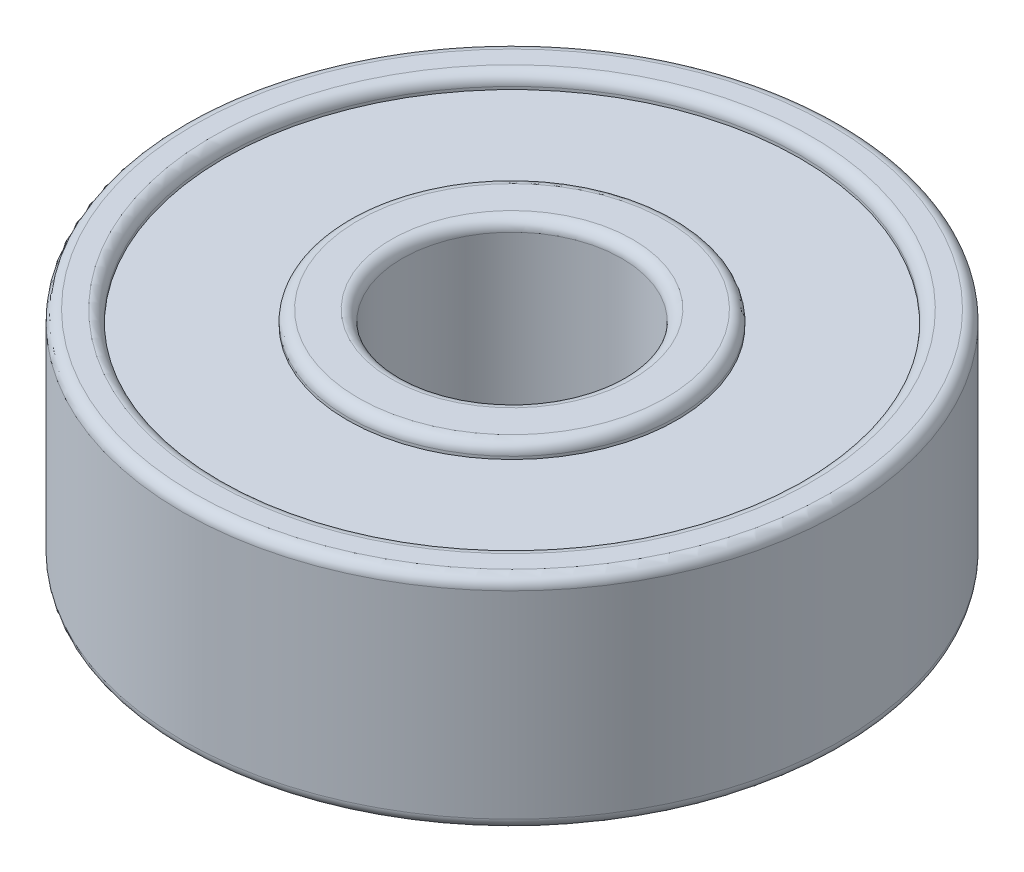
ISO-10303-21;
HEADER;
FILE_DESCRIPTION(('STEP AP214'),'2;1');
FILE_NAME('part.step','',(''),(''),'','','');
FILE_SCHEMA(('AUTOMOTIVE_DESIGN { 1 0 10303 214 1 1 1 1 }'));
ENDSEC;
DATA;
#1=APPLICATION_CONTEXT('core data for automotive mechanical design processes');
#2=APPLICATION_PROTOCOL_DEFINITION('international standard','automotive_design',2000,#1);
#3=PRODUCT_CONTEXT('',#1,'mechanical');
#4=PRODUCT('Part','Part','',(#3));
#5=PRODUCT_RELATED_PRODUCT_CATEGORY('part','',(#4));
#6=PRODUCT_DEFINITION_FORMATION('','',#4);
#7=PRODUCT_DEFINITION_CONTEXT('part definition',#1,'design');
#8=PRODUCT_DEFINITION('design','',#6,#7);
#9=PRODUCT_DEFINITION_SHAPE('','',#8);
#10=(LENGTH_UNIT() NAMED_UNIT(*) SI_UNIT(.MILLI.,.METRE.));
#11=(NAMED_UNIT(*) PLANE_ANGLE_UNIT() SI_UNIT($,.RADIAN.));
#12=(NAMED_UNIT(*) SI_UNIT($,.STERADIAN.) SOLID_ANGLE_UNIT());
#13=UNCERTAINTY_MEASURE_WITH_UNIT(LENGTH_MEASURE(1.E-05),#10,'distance_accuracy_value','');
#14=(GEOMETRIC_REPRESENTATION_CONTEXT(3) GLOBAL_UNCERTAINTY_ASSIGNED_CONTEXT((#13)) GLOBAL_UNIT_ASSIGNED_CONTEXT((#10,
#11,#12)) REPRESENTATION_CONTEXT('',''));
#15=CARTESIAN_POINT('',(0.,0.,0.));
#16=DIRECTION('',(0.,0.,1.));
#17=DIRECTION('',(1.,0.,0.));
#18=AXIS2_PLACEMENT_3D('',#15,#16,#17);
#19=CARTESIAN_POINT('',(0.,0.,0.));
#20=DIRECTION('',(0.,1.,0.));
#21=DIRECTION('',(0.,0.,1.));
#22=AXIS2_PLACEMENT_3D('',#19,#20,#21);
#23=PLANE('',#22);
#24=CARTESIAN_POINT('',(0.,0.,0.));
#25=DIRECTION('',(0.,1.,0.));
#26=DIRECTION('',(0.,0.,1.));
#27=AXIS2_PLACEMENT_3D('',#24,#25,#26);
#28=CIRCLE('',#27,2.2);
#29=CARTESIAN_POINT('',(0.,0.,2.2));
#30=VERTEX_POINT('',#29);
#31=EDGE_CURVE('E42',#30,#30,#28,.T.);
#32=ORIENTED_EDGE('',*,*,#31,.T.);
#33=EDGE_LOOP('',(#32));
#34=FACE_BOUND('',#33,.T.);
#35=CARTESIAN_POINT('',(0.,0.,0.));
#36=DIRECTION('',(0.,1.,0.));
#37=DIRECTION('',(0.,0.,1.));
#38=AXIS2_PLACEMENT_3D('',#35,#36,#37);
#39=CIRCLE('',#38,2.8);
#40=CARTESIAN_POINT('',(0.,0.,2.8));
#41=VERTEX_POINT('',#40);
#42=EDGE_CURVE('E46',#41,#41,#39,.F.);
#43=ORIENTED_EDGE('',*,*,#42,.T.);
#44=EDGE_LOOP('',(#43));
#45=FACE_BOUND('',#44,.T.);
#46=ADVANCED_FACE('F31',(#34,#45),#23,.F.);
#47=CARTESIAN_POINT('',(0.,4.,0.));
#48=DIRECTION('',(0.,1.,0.));
#49=DIRECTION('',(0.,0.,1.));
#50=AXIS2_PLACEMENT_3D('',#47,#48,#49);
#51=PLANE('',#50);
#52=CARTESIAN_POINT('',(0.,4.,0.));
#53=DIRECTION('',(0.,1.,0.));
#54=DIRECTION('',(0.,0.,1.));
#55=AXIS2_PLACEMENT_3D('',#52,#53,#54);
#56=CIRCLE('',#55,2.2);
#57=CARTESIAN_POINT('',(0.,4.,2.2));
#58=VERTEX_POINT('',#57);
#59=EDGE_CURVE('E75',#58,#58,#56,.F.);
#60=ORIENTED_EDGE('',*,*,#59,.T.);
#61=EDGE_LOOP('',(#60));
#62=FACE_BOUND('',#61,.T.);
#63=CARTESIAN_POINT('',(0.,4.,0.));
#64=DIRECTION('',(0.,1.,0.));
#65=DIRECTION('',(0.,0.,1.));
#66=AXIS2_PLACEMENT_3D('',#63,#64,#65);
#67=CIRCLE('',#66,2.8);
#68=CARTESIAN_POINT('',(0.,4.,2.8));
#69=VERTEX_POINT('',#68);
#70=EDGE_CURVE('E78',#69,#69,#67,.T.);
#71=ORIENTED_EDGE('',*,*,#70,.T.);
#72=EDGE_LOOP('',(#71));
#73=FACE_BOUND('',#72,.T.);
#74=ADVANCED_FACE('F119',(#62,#73),#51,.T.);
#75=CARTESIAN_POINT('',(0.,4.,0.));
#76=DIRECTION('',(0.,1.,0.));
#77=DIRECTION('',(0.,0.,1.));
#78=AXIS2_PLACEMENT_3D('',#75,#76,#77);
#79=CIRCLE('',#78,5.45);
#80=CARTESIAN_POINT('',(0.,4.,5.45));
#81=VERTEX_POINT('',#80);
#82=EDGE_CURVE('E63',#81,#81,#79,.F.);
#83=ORIENTED_EDGE('',*,*,#82,.T.);
#84=EDGE_LOOP('',(#83));
#85=FACE_BOUND('',#84,.T.);
#86=CARTESIAN_POINT('',(0.,4.,0.));
#87=DIRECTION('',(0.,1.,0.));
#88=DIRECTION('',(0.,0.,1.));
#89=AXIS2_PLACEMENT_3D('',#86,#87,#88);
#90=CIRCLE('',#89,5.8);
#91=CARTESIAN_POINT('',(0.,4.,5.8));
#92=VERTEX_POINT('',#91);
#93=EDGE_CURVE('E66',#92,#92,#90,.T.);
#94=ORIENTED_EDGE('',*,*,#93,.T.);
#95=EDGE_LOOP('',(#94));
#96=FACE_BOUND('',#95,.T.);
#97=ADVANCED_FACE('F127',(#85,#96),#51,.T.);
#98=CARTESIAN_POINT('',(0.,0.,0.));
#99=DIRECTION('',(0.,1.,0.));
#100=DIRECTION('',(0.,0.,1.));
#101=AXIS2_PLACEMENT_3D('',#98,#99,#100);
#102=CIRCLE('',#101,5.8);
#103=CARTESIAN_POINT('',(0.,0.,5.8));
#104=VERTEX_POINT('',#103);
#105=EDGE_CURVE('E51',#104,#104,#102,.F.);
#106=ORIENTED_EDGE('',*,*,#105,.T.);
#107=EDGE_LOOP('',(#106));
#108=FACE_BOUND('',#107,.T.);
#109=CARTESIAN_POINT('',(0.,0.,0.));
#110=DIRECTION('',(0.,1.,0.));
#111=DIRECTION('',(0.,0.,1.));
#112=AXIS2_PLACEMENT_3D('',#109,#110,#111);
#113=CIRCLE('',#112,5.45);
#114=CARTESIAN_POINT('',(0.,0.,5.45));
#115=VERTEX_POINT('',#114);
#116=EDGE_CURVE('E54',#115,#115,#113,.T.);
#117=ORIENTED_EDGE('',*,*,#116,.T.);
#118=EDGE_LOOP('',(#117));
#119=FACE_BOUND('',#118,.T.);
#120=ADVANCED_FACE('F122',(#108,#119),#23,.F.);
#121=CARTESIAN_POINT('',(0.,4.,0.));
#122=DIRECTION('',(0.,-1.,0.));
#123=DIRECTION('',(0.,0.,-1.));
#124=AXIS2_PLACEMENT_3D('',#121,#122,#123);
#125=CYLINDRICAL_SURFACE('',#124,6.);
#126=CARTESIAN_POINT('',(0.,3.8,0.));
#127=DIRECTION('',(0.,1.,0.));
#128=DIRECTION('',(0.,0.,1.));
#129=AXIS2_PLACEMENT_3D('',#126,#127,#128);
#130=CIRCLE('',#129,6.);
#131=CARTESIAN_POINT('',(0.,3.8,6.));
#132=VERTEX_POINT('',#131);
#133=EDGE_CURVE('E57',#132,#132,#130,.F.);
#134=ORIENTED_EDGE('',*,*,#133,.T.);
#135=EDGE_LOOP('',(#134));
#136=FACE_BOUND('',#135,.T.);
#137=CARTESIAN_POINT('',(0.,0.2,0.));
#138=DIRECTION('',(0.,1.,0.));
#139=DIRECTION('',(0.,0.,1.));
#140=AXIS2_PLACEMENT_3D('',#137,#138,#139);
#141=CIRCLE('',#140,6.);
#142=CARTESIAN_POINT('',(0.,0.2,6.));
#143=VERTEX_POINT('',#142);
#144=EDGE_CURVE('E60',#143,#143,#141,.T.);
#145=ORIENTED_EDGE('',*,*,#144,.T.);
#146=EDGE_LOOP('',(#145));
#147=FACE_BOUND('',#146,.T.);
#148=ADVANCED_FACE('F133',(#136,#147),#125,.T.);
#149=CARTESIAN_POINT('',(0.,4.,0.));
#150=DIRECTION('',(0.,-1.,0.));
#151=DIRECTION('',(0.,0.,-1.));
#152=AXIS2_PLACEMENT_3D('',#149,#150,#151);
#153=CYLINDRICAL_SURFACE('',#152,2.);
#154=CARTESIAN_POINT('',(0.,3.8,0.));
#155=DIRECTION('',(0.,1.,0.));
#156=DIRECTION('',(0.,0.,1.));
#157=AXIS2_PLACEMENT_3D('',#154,#155,#156);
#158=CIRCLE('',#157,2.);
#159=CARTESIAN_POINT('',(0.,3.8,2.));
#160=VERTEX_POINT('',#159);
#161=EDGE_CURVE('E81',#160,#160,#158,.T.);
#162=ORIENTED_EDGE('',*,*,#161,.T.);
#163=EDGE_LOOP('',(#162));
#164=FACE_BOUND('',#163,.T.);
#165=CARTESIAN_POINT('',(0.,0.2,0.));
#166=DIRECTION('',(0.,1.,0.));
#167=DIRECTION('',(0.,0.,1.));
#168=AXIS2_PLACEMENT_3D('',#165,#166,#167);
#169=CIRCLE('',#168,2.);
#170=CARTESIAN_POINT('',(0.,0.2,2.));
#171=VERTEX_POINT('',#170);
#172=EDGE_CURVE('E84',#171,#171,#169,.F.);
#173=ORIENTED_EDGE('',*,*,#172,.T.);
#174=EDGE_LOOP('',(#173));
#175=FACE_BOUND('',#174,.T.);
#176=ADVANCED_FACE('F139',(#164,#175),#153,.F.);
#177=CARTESIAN_POINT('',(0.,3.75,0.));
#178=DIRECTION('',(0.,1.,0.));
#179=DIRECTION('',(0.,0.,1.));
#180=AXIS2_PLACEMENT_3D('',#177,#178,#179);
#181=CYLINDRICAL_SURFACE('',#180,5.25);
#182=CARTESIAN_POINT('',(0.,3.8,0.));
#183=DIRECTION('',(0.,1.,0.));
#184=DIRECTION('',(0.,0.,1.));
#185=AXIS2_PLACEMENT_3D('',#182,#183,#184);
#186=CIRCLE('',#185,5.25);
#187=CARTESIAN_POINT('',(0.,3.8,5.25));
#188=VERTEX_POINT('',#187);
#189=EDGE_CURVE('E69',#188,#188,#186,.T.);
#190=ORIENTED_EDGE('',*,*,#189,.T.);
#191=EDGE_LOOP('',(#190));
#192=FACE_BOUND('',#191,.T.);
#193=CARTESIAN_POINT('',(0.,3.75,0.));
#194=DIRECTION('',(0.,1.,0.));
#195=DIRECTION('',(0.,0.,1.));
#196=AXIS2_PLACEMENT_3D('',#193,#194,#195);
#197=CIRCLE('',#196,5.25);
#198=CARTESIAN_POINT('',(0.,3.75,5.25));
#199=VERTEX_POINT('',#198);
#200=EDGE_CURVE('E87',#199,#199,#197,.T.);
#201=ORIENTED_EDGE('',*,*,#200,.F.);
#202=EDGE_LOOP('',(#201));
#203=FACE_BOUND('',#202,.T.);
#204=ADVANCED_FACE('F190',(#192,#203),#181,.F.);
#205=CARTESIAN_POINT('',(0.,3.75,0.));
#206=DIRECTION('',(0.,1.,0.));
#207=DIRECTION('',(0.,0.,1.));
#208=AXIS2_PLACEMENT_3D('',#205,#206,#207);
#209=PLANE('',#208);
#210=CARTESIAN_POINT('',(0.,3.75,0.));
#211=DIRECTION('',(0.,1.,0.));
#212=DIRECTION('',(0.,0.,1.));
#213=AXIS2_PLACEMENT_3D('',#210,#211,#212);
#214=CIRCLE('',#213,3.);
#215=CARTESIAN_POINT('',(0.,3.75,3.));
#216=VERTEX_POINT('',#215);
#217=EDGE_CURVE('E90',#216,#216,#214,.T.);
#218=ORIENTED_EDGE('',*,*,#217,.F.);
#219=EDGE_LOOP('',(#218));
#220=FACE_BOUND('',#219,.T.);
#221=ORIENTED_EDGE('',*,*,#200,.T.);
#222=EDGE_LOOP('',(#221));
#223=FACE_BOUND('',#222,.T.);
#224=ADVANCED_FACE('F115',(#220,#223),#209,.T.);
#225=CARTESIAN_POINT('',(0.,3.75,0.));
#226=DIRECTION('',(0.,1.,0.));
#227=DIRECTION('',(0.,0.,1.));
#228=AXIS2_PLACEMENT_3D('',#225,#226,#227);
#229=CYLINDRICAL_SURFACE('',#228,3.);
#230=CARTESIAN_POINT('',(0.,3.8,0.));
#231=DIRECTION('',(0.,1.,0.));
#232=DIRECTION('',(0.,0.,1.));
#233=AXIS2_PLACEMENT_3D('',#230,#231,#232);
#234=CIRCLE('',#233,3.);
#235=CARTESIAN_POINT('',(0.,3.8,3.));
#236=VERTEX_POINT('',#235);
#237=EDGE_CURVE('E72',#236,#236,#234,.F.);
#238=ORIENTED_EDGE('',*,*,#237,.T.);
#239=EDGE_LOOP('',(#238));
#240=FACE_BOUND('',#239,.T.);
#241=ORIENTED_EDGE('',*,*,#217,.T.);
#242=EDGE_LOOP('',(#241));
#243=FACE_BOUND('',#242,.T.);
#244=ADVANCED_FACE('F110',(#240,#243),#229,.T.);
#245=CARTESIAN_POINT('',(0.,0.25,0.));
#246=DIRECTION('',(0.,-1.,0.));
#247=DIRECTION('',(0.,0.,-1.));
#248=AXIS2_PLACEMENT_3D('',#245,#246,#247);
#249=CYLINDRICAL_SURFACE('',#248,5.25);
#250=CARTESIAN_POINT('',(0.,0.2,0.));
#251=DIRECTION('',(0.,1.,0.));
#252=DIRECTION('',(0.,0.,1.));
#253=AXIS2_PLACEMENT_3D('',#250,#251,#252);
#254=CIRCLE('',#253,5.25);
#255=CARTESIAN_POINT('',(0.,0.2,5.25));
#256=VERTEX_POINT('',#255);
#257=EDGE_CURVE('E10',#256,#256,#254,.F.);
#258=ORIENTED_EDGE('',*,*,#257,.T.);
#259=EDGE_LOOP('',(#258));
#260=FACE_BOUND('',#259,.T.);
#261=CARTESIAN_POINT('',(0.,0.25,0.));
#262=DIRECTION('',(0.,-1.,0.));
#263=DIRECTION('',(0.,0.,-1.));
#264=AXIS2_PLACEMENT_3D('',#261,#262,#263);
#265=CIRCLE('',#264,5.25);
#266=CARTESIAN_POINT('',(0.,0.25,-5.25));
#267=VERTEX_POINT('',#266);
#268=EDGE_CURVE('E93',#267,#267,#265,.T.);
#269=ORIENTED_EDGE('',*,*,#268,.F.);
#270=EDGE_LOOP('',(#269));
#271=FACE_BOUND('',#270,.T.);
#272=ADVANCED_FACE('F105',(#260,#271),#249,.F.);
#273=CARTESIAN_POINT('',(0.,0.25,0.));
#274=DIRECTION('',(0.,-1.,0.));
#275=DIRECTION('',(0.,0.,-1.));
#276=AXIS2_PLACEMENT_3D('',#273,#274,#275);
#277=PLANE('',#276);
#278=CARTESIAN_POINT('',(0.,0.25,0.));
#279=DIRECTION('',(0.,-1.,0.));
#280=DIRECTION('',(0.,0.,-1.));
#281=AXIS2_PLACEMENT_3D('',#278,#279,#280);
#282=CIRCLE('',#281,3.);
#283=CARTESIAN_POINT('',(0.,0.25,-3.));
#284=VERTEX_POINT('',#283);
#285=EDGE_CURVE('E96',#284,#284,#282,.T.);
#286=ORIENTED_EDGE('',*,*,#285,.F.);
#287=EDGE_LOOP('',(#286));
#288=FACE_BOUND('',#287,.T.);
#289=ORIENTED_EDGE('',*,*,#268,.T.);
#290=EDGE_LOOP('',(#289));
#291=FACE_BOUND('',#290,.T.);
#292=ADVANCED_FACE('F102',(#288,#291),#277,.T.);
#293=CARTESIAN_POINT('',(0.,0.25,0.));
#294=DIRECTION('',(0.,-1.,0.));
#295=DIRECTION('',(0.,0.,-1.));
#296=AXIS2_PLACEMENT_3D('',#293,#294,#295);
#297=CYLINDRICAL_SURFACE('',#296,3.);
#298=CARTESIAN_POINT('',(0.,0.2,0.));
#299=DIRECTION('',(0.,1.,0.));
#300=DIRECTION('',(0.,0.,1.));
#301=AXIS2_PLACEMENT_3D('',#298,#299,#300);
#302=CIRCLE('',#301,3.);
#303=CARTESIAN_POINT('',(0.,0.2,3.));
#304=VERTEX_POINT('',#303);
#305=EDGE_CURVE('E38',#304,#304,#302,.T.);
#306=ORIENTED_EDGE('',*,*,#305,.T.);
#307=EDGE_LOOP('',(#306));
#308=FACE_BOUND('',#307,.T.);
#309=ORIENTED_EDGE('',*,*,#285,.T.);
#310=EDGE_LOOP('',(#309));
#311=FACE_BOUND('',#310,.T.);
#312=ADVANCED_FACE('F100',(#308,#311),#297,.T.);
#313=CARTESIAN_POINT('',(0.,3.8,0.));
#314=DIRECTION('',(0.,1.,0.));
#315=DIRECTION('',(0.,0.,1.));
#316=AXIS2_PLACEMENT_3D('',#313,#314,#315);
#317=TOROIDAL_SURFACE('',#316,2.2,0.2);
#318=ORIENTED_EDGE('',*,*,#59,.F.);
#319=EDGE_LOOP('',(#318));
#320=FACE_BOUND('',#319,.T.);
#321=ORIENTED_EDGE('',*,*,#161,.F.);
#322=EDGE_LOOP('',(#321));
#323=FACE_BOUND('',#322,.T.);
#324=ADVANCED_FACE('F176',(#320,#323),#317,.T.);
#325=CARTESIAN_POINT('',(0.,3.8,0.));
#326=DIRECTION('',(0.,1.,0.));
#327=DIRECTION('',(0.,0.,1.));
#328=AXIS2_PLACEMENT_3D('',#325,#326,#327);
#329=TOROIDAL_SURFACE('',#328,2.8,0.2);
#330=ORIENTED_EDGE('',*,*,#237,.F.);
#331=EDGE_LOOP('',(#330));
#332=FACE_BOUND('',#331,.T.);
#333=ORIENTED_EDGE('',*,*,#70,.F.);
#334=EDGE_LOOP('',(#333));
#335=FACE_BOUND('',#334,.T.);
#336=ADVANCED_FACE('F172',(#332,#335),#329,.T.);
#337=CARTESIAN_POINT('',(0.,3.8,0.));
#338=DIRECTION('',(0.,1.,0.));
#339=DIRECTION('',(0.,0.,1.));
#340=AXIS2_PLACEMENT_3D('',#337,#338,#339);
#341=TOROIDAL_SURFACE('',#340,5.45,0.2);
#342=ORIENTED_EDGE('',*,*,#82,.F.);
#343=EDGE_LOOP('',(#342));
#344=FACE_BOUND('',#343,.T.);
#345=ORIENTED_EDGE('',*,*,#189,.F.);
#346=EDGE_LOOP('',(#345));
#347=FACE_BOUND('',#346,.T.);
#348=ADVANCED_FACE('F168',(#344,#347),#341,.T.);
#349=CARTESIAN_POINT('',(0.,3.8,0.));
#350=DIRECTION('',(0.,1.,0.));
#351=DIRECTION('',(0.,0.,1.));
#352=AXIS2_PLACEMENT_3D('',#349,#350,#351);
#353=TOROIDAL_SURFACE('',#352,5.8,0.2);
#354=ORIENTED_EDGE('',*,*,#133,.F.);
#355=EDGE_LOOP('',(#354));
#356=FACE_BOUND('',#355,.T.);
#357=ORIENTED_EDGE('',*,*,#93,.F.);
#358=EDGE_LOOP('',(#357));
#359=FACE_BOUND('',#358,.T.);
#360=ADVANCED_FACE('F164',(#356,#359),#353,.T.);
#361=CARTESIAN_POINT('',(0.,0.2,0.));
#362=DIRECTION('',(0.,1.,0.));
#363=DIRECTION('',(0.,0.,1.));
#364=AXIS2_PLACEMENT_3D('',#361,#362,#363);
#365=TOROIDAL_SURFACE('',#364,5.8,0.2);
#366=ORIENTED_EDGE('',*,*,#105,.F.);
#367=EDGE_LOOP('',(#366));
#368=FACE_BOUND('',#367,.T.);
#369=ORIENTED_EDGE('',*,*,#144,.F.);
#370=EDGE_LOOP('',(#369));
#371=FACE_BOUND('',#370,.T.);
#372=ADVANCED_FACE('F157',(#368,#371),#365,.T.);
#373=CARTESIAN_POINT('',(0.,0.2,0.));
#374=DIRECTION('',(0.,1.,0.));
#375=DIRECTION('',(0.,0.,1.));
#376=AXIS2_PLACEMENT_3D('',#373,#374,#375);
#377=TOROIDAL_SURFACE('',#376,2.2,0.2);
#378=ORIENTED_EDGE('',*,*,#172,.F.);
#379=EDGE_LOOP('',(#378));
#380=FACE_BOUND('',#379,.T.);
#381=ORIENTED_EDGE('',*,*,#31,.F.);
#382=EDGE_LOOP('',(#381));
#383=FACE_BOUND('',#382,.T.);
#384=ADVANCED_FACE('F152',(#380,#383),#377,.T.);
#385=CARTESIAN_POINT('',(0.,0.2,0.));
#386=DIRECTION('',(0.,1.,0.));
#387=DIRECTION('',(0.,0.,1.));
#388=AXIS2_PLACEMENT_3D('',#385,#386,#387);
#389=TOROIDAL_SURFACE('',#388,2.8,0.2);
#390=ORIENTED_EDGE('',*,*,#305,.F.);
#391=EDGE_LOOP('',(#390));
#392=FACE_BOUND('',#391,.T.);
#393=ORIENTED_EDGE('',*,*,#42,.F.);
#394=EDGE_LOOP('',(#393));
#395=FACE_BOUND('',#394,.T.);
#396=ADVANCED_FACE('F148',(#392,#395),#389,.T.);
#397=CARTESIAN_POINT('',(0.,0.2,0.));
#398=DIRECTION('',(0.,1.,0.));
#399=DIRECTION('',(0.,0.,1.));
#400=AXIS2_PLACEMENT_3D('',#397,#398,#399);
#401=TOROIDAL_SURFACE('',#400,5.45,0.2);
#402=ORIENTED_EDGE('',*,*,#116,.F.);
#403=EDGE_LOOP('',(#402));
#404=FACE_BOUND('',#403,.T.);
#405=ORIENTED_EDGE('',*,*,#257,.F.);
#406=EDGE_LOOP('',(#405));
#407=FACE_BOUND('',#406,.T.);
#408=ADVANCED_FACE('F33',(#404,#407),#401,.T.);
#409=CLOSED_SHELL('',(#46,#74,#97,#120,#148,#176,#204,#224,#244,#272,#292,#312,#324,#336,#348,
#360,#372,#384,#396,#408));
#410=MANIFOLD_SOLID_BREP('B2',#409);
#411=ADVANCED_BREP_SHAPE_REPRESENTATION('',(#18,#410),#14);
#412=SHAPE_DEFINITION_REPRESENTATION(#9,#411);
ENDSEC;
END-ISO-10303-21;
